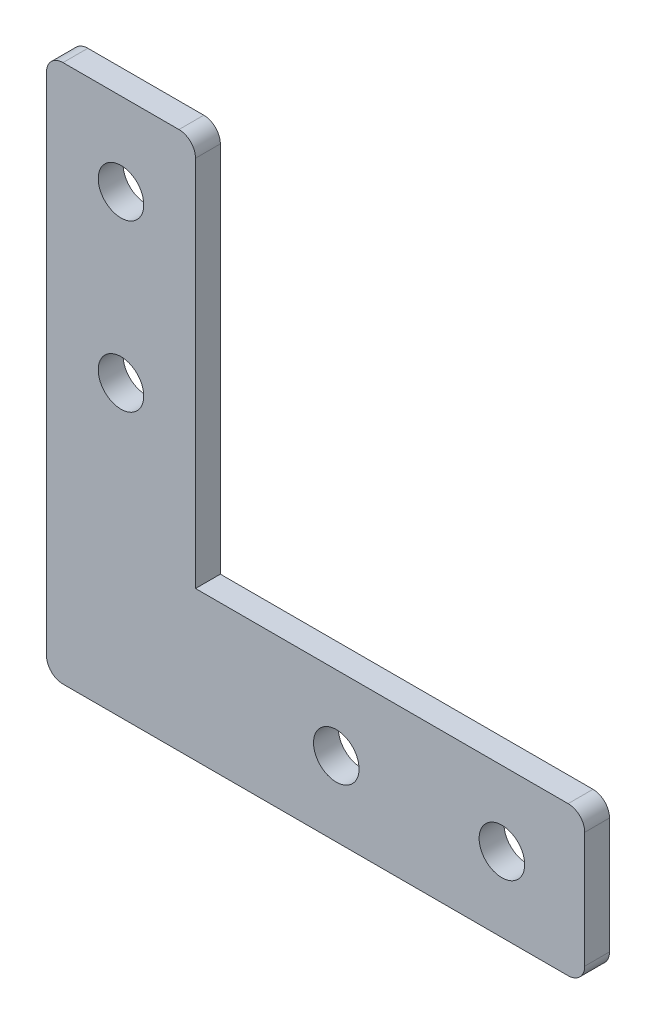
ISO-10303-21;
HEADER;
FILE_DESCRIPTION(('STEP AP214'),'2;1');
FILE_NAME('part.step','',(''),(''),'','','');
FILE_SCHEMA(('AUTOMOTIVE_DESIGN { 1 0 10303 214 1 1 1 1 }'));
ENDSEC;
DATA;
#1=APPLICATION_CONTEXT('core data for automotive mechanical design processes');
#2=APPLICATION_PROTOCOL_DEFINITION('international standard','automotive_design',2000,#1);
#3=PRODUCT_CONTEXT('',#1,'mechanical');
#4=PRODUCT('Part','Part','',(#3));
#5=PRODUCT_RELATED_PRODUCT_CATEGORY('part','',(#4));
#6=PRODUCT_DEFINITION_FORMATION('','',#4);
#7=PRODUCT_DEFINITION_CONTEXT('part definition',#1,'design');
#8=PRODUCT_DEFINITION('design','',#6,#7);
#9=PRODUCT_DEFINITION_SHAPE('','',#8);
#10=(LENGTH_UNIT() NAMED_UNIT(*) SI_UNIT(.MILLI.,.METRE.));
#11=(NAMED_UNIT(*) PLANE_ANGLE_UNIT() SI_UNIT($,.RADIAN.));
#12=(NAMED_UNIT(*) SI_UNIT($,.STERADIAN.) SOLID_ANGLE_UNIT());
#13=UNCERTAINTY_MEASURE_WITH_UNIT(LENGTH_MEASURE(1.E-05),#10,'distance_accuracy_value','');
#14=(GEOMETRIC_REPRESENTATION_CONTEXT(3) GLOBAL_UNCERTAINTY_ASSIGNED_CONTEXT((#13)) GLOBAL_UNIT_ASSIGNED_CONTEXT((#10,
#11,#12)) REPRESENTATION_CONTEXT('',''));
#15=CARTESIAN_POINT('',(0.,0.,0.));
#16=DIRECTION('',(0.,0.,1.));
#17=DIRECTION('',(1.,0.,0.));
#18=AXIS2_PLACEMENT_3D('',#15,#16,#17);
#19=CARTESIAN_POINT('',(47.,0.,3.));
#20=DIRECTION('',(0.,-1.,0.));
#21=DIRECTION('',(0.,0.,-1.));
#22=AXIS2_PLACEMENT_3D('',#19,#20,#21);
#23=PLANE('',#22);
#24=DIRECTION('',(-1.,0.,0.));
#25=VECTOR('',#24,1.);
#26=CARTESIAN_POINT('',(47.,0.,3.));
#27=LINE('',#26,#25);
#28=CARTESIAN_POINT('',(45.,0.,3.));
#29=VERTEX_POINT('',#28);
#30=CARTESIAN_POINT('',(0.,0.,3.));
#31=VERTEX_POINT('',#30);
#32=EDGE_CURVE('E116',#29,#31,#27,.T.);
#33=ORIENTED_EDGE('',*,*,#32,.F.);
#34=DIRECTION('',(0.,0.,-1.));
#35=VECTOR('',#34,1.);
#36=CARTESIAN_POINT('',(45.,0.,3.));
#37=LINE('',#36,#35);
#38=CARTESIAN_POINT('',(45.,0.,0.));
#39=VERTEX_POINT('',#38);
#40=EDGE_CURVE('E141',#29,#39,#37,.T.);
#41=ORIENTED_EDGE('',*,*,#40,.T.);
#42=DIRECTION('',(-1.,0.,0.));
#43=VECTOR('',#42,1.);
#44=CARTESIAN_POINT('',(47.,0.,0.));
#45=LINE('',#44,#43);
#46=CARTESIAN_POINT('',(0.,0.,0.));
#47=VERTEX_POINT('',#46);
#48=EDGE_CURVE('E139',#39,#47,#45,.T.);
#49=ORIENTED_EDGE('',*,*,#48,.T.);
#50=DIRECTION('',(0.,0.,-1.));
#51=VECTOR('',#50,1.);
#52=CARTESIAN_POINT('',(0.,0.,3.));
#53=LINE('',#52,#51);
#54=EDGE_CURVE('E134',#31,#47,#53,.T.);
#55=ORIENTED_EDGE('',*,*,#54,.F.);
#56=EDGE_LOOP('',(#33,#41,#49,#55));
#57=FACE_BOUND('',#56,.T.);
#58=ADVANCED_FACE('F33',(#57),#23,.F.);
#59=CARTESIAN_POINT('',(0.,0.,3.));
#60=DIRECTION('',(-1.,0.,0.));
#61=DIRECTION('',(0.,-1.,0.));
#62=AXIS2_PLACEMENT_3D('',#59,#60,#61);
#63=PLANE('',#62);
#64=DIRECTION('',(0.,1.,0.));
#65=VECTOR('',#64,1.);
#66=CARTESIAN_POINT('',(0.,0.,0.));
#67=LINE('',#66,#65);
#68=CARTESIAN_POINT('',(0.,45.,0.));
#69=VERTEX_POINT('',#68);
#70=EDGE_CURVE('E211',#47,#69,#67,.T.);
#71=ORIENTED_EDGE('',*,*,#70,.T.);
#72=DIRECTION('',(0.,0.,-1.));
#73=VECTOR('',#72,1.);
#74=CARTESIAN_POINT('',(0.,45.,3.));
#75=LINE('',#74,#73);
#76=CARTESIAN_POINT('',(0.,45.,3.));
#77=VERTEX_POINT('',#76);
#78=EDGE_CURVE('E11',#69,#77,#75,.F.);
#79=ORIENTED_EDGE('',*,*,#78,.T.);
#80=DIRECTION('',(0.,1.,0.));
#81=VECTOR('',#80,1.);
#82=CARTESIAN_POINT('',(0.,0.,3.));
#83=LINE('',#82,#81);
#84=EDGE_CURVE('E120',#31,#77,#83,.T.);
#85=ORIENTED_EDGE('',*,*,#84,.F.);
#86=ORIENTED_EDGE('',*,*,#54,.T.);
#87=EDGE_LOOP('',(#71,#79,#85,#86));
#88=FACE_BOUND('',#87,.T.);
#89=ADVANCED_FACE('F133',(#88),#63,.F.);
#90=CARTESIAN_POINT('',(0.,47.,3.));
#91=DIRECTION('',(0.,-1.,0.));
#92=DIRECTION('',(0.,0.,-1.));
#93=AXIS2_PLACEMENT_3D('',#90,#91,#92);
#94=PLANE('',#93);
#95=DIRECTION('',(-1.,0.,0.));
#96=VECTOR('',#95,1.);
#97=CARTESIAN_POINT('',(0.,47.,0.));
#98=LINE('',#97,#96);
#99=CARTESIAN_POINT('',(-2.,47.,0.));
#100=VERTEX_POINT('',#99);
#101=CARTESIAN_POINT('',(-16.,47.,0.));
#102=VERTEX_POINT('',#101);
#103=EDGE_CURVE('E192',#100,#102,#98,.T.);
#104=ORIENTED_EDGE('',*,*,#103,.T.);
#105=DIRECTION('',(0.,0.,-1.));
#106=VECTOR('',#105,1.);
#107=CARTESIAN_POINT('',(-16.,47.,3.));
#108=LINE('',#107,#106);
#109=CARTESIAN_POINT('',(-16.,47.,3.));
#110=VERTEX_POINT('',#109);
#111=EDGE_CURVE('E41',#102,#110,#108,.F.);
#112=ORIENTED_EDGE('',*,*,#111,.T.);
#113=DIRECTION('',(-1.,0.,0.));
#114=VECTOR('',#113,1.);
#115=CARTESIAN_POINT('',(0.,47.,3.));
#116=LINE('',#115,#114);
#117=CARTESIAN_POINT('',(-2.,47.,3.));
#118=VERTEX_POINT('',#117);
#119=EDGE_CURVE('E136',#118,#110,#116,.T.);
#120=ORIENTED_EDGE('',*,*,#119,.F.);
#121=DIRECTION('',(0.,0.,-1.));
#122=VECTOR('',#121,1.);
#123=CARTESIAN_POINT('',(-2.,47.,3.));
#124=LINE('',#123,#122);
#125=EDGE_CURVE('E182',#118,#100,#124,.T.);
#126=ORIENTED_EDGE('',*,*,#125,.T.);
#127=EDGE_LOOP('',(#104,#112,#120,#126));
#128=FACE_BOUND('',#127,.T.);
#129=ADVANCED_FACE('F189',(#128),#94,.F.);
#130=CARTESIAN_POINT('',(-18.,47.,3.));
#131=DIRECTION('',(1.,0.,0.));
#132=DIRECTION('',(0.,1.,0.));
#133=AXIS2_PLACEMENT_3D('',#130,#131,#132);
#134=PLANE('',#133);
#135=DIRECTION('',(0.,-1.,0.));
#136=VECTOR('',#135,1.);
#137=CARTESIAN_POINT('',(-18.,47.,0.));
#138=LINE('',#137,#136);
#139=CARTESIAN_POINT('',(-18.,45.,0.));
#140=VERTEX_POINT('',#139);
#141=CARTESIAN_POINT('',(-18.,-16.,0.));
#142=VERTEX_POINT('',#141);
#143=EDGE_CURVE('E204',#140,#142,#138,.T.);
#144=ORIENTED_EDGE('',*,*,#143,.T.);
#145=DIRECTION('',(0.,0.,-1.));
#146=VECTOR('',#145,1.);
#147=CARTESIAN_POINT('',(-18.,-16.,3.));
#148=LINE('',#147,#146);
#149=CARTESIAN_POINT('',(-18.,-16.,3.));
#150=VERTEX_POINT('',#149);
#151=EDGE_CURVE('E180',#142,#150,#148,.F.);
#152=ORIENTED_EDGE('',*,*,#151,.T.);
#153=DIRECTION('',(0.,-1.,0.));
#154=VECTOR('',#153,1.);
#155=CARTESIAN_POINT('',(-18.,47.,3.));
#156=LINE('',#155,#154);
#157=CARTESIAN_POINT('',(-18.,45.,3.));
#158=VERTEX_POINT('',#157);
#159=EDGE_CURVE('E196',#158,#150,#156,.T.);
#160=ORIENTED_EDGE('',*,*,#159,.F.);
#161=DIRECTION('',(0.,0.,-1.));
#162=VECTOR('',#161,1.);
#163=CARTESIAN_POINT('',(-18.,45.,3.));
#164=LINE('',#163,#162);
#165=EDGE_CURVE('E177',#158,#140,#164,.T.);
#166=ORIENTED_EDGE('',*,*,#165,.T.);
#167=EDGE_LOOP('',(#144,#152,#160,#166));
#168=FACE_BOUND('',#167,.T.);
#169=ADVANCED_FACE('F203',(#168),#134,.F.);
#170=CARTESIAN_POINT('',(-18.,-18.,3.));
#171=DIRECTION('',(0.,1.,0.));
#172=DIRECTION('',(0.,0.,1.));
#173=AXIS2_PLACEMENT_3D('',#170,#171,#172);
#174=PLANE('',#173);
#175=DIRECTION('',(1.,0.,0.));
#176=VECTOR('',#175,1.);
#177=CARTESIAN_POINT('',(-18.,-18.,0.));
#178=LINE('',#177,#176);
#179=CARTESIAN_POINT('',(-16.,-18.,0.));
#180=VERTEX_POINT('',#179);
#181=CARTESIAN_POINT('',(45.,-18.,0.));
#182=VERTEX_POINT('',#181);
#183=EDGE_CURVE('E209',#180,#182,#178,.T.);
#184=ORIENTED_EDGE('',*,*,#183,.T.);
#185=DIRECTION('',(0.,0.,-1.));
#186=VECTOR('',#185,1.);
#187=CARTESIAN_POINT('',(45.,-18.,3.));
#188=LINE('',#187,#186);
#189=CARTESIAN_POINT('',(45.,-18.,3.));
#190=VERTEX_POINT('',#189);
#191=EDGE_CURVE('E48',#182,#190,#188,.F.);
#192=ORIENTED_EDGE('',*,*,#191,.T.);
#193=DIRECTION('',(1.,0.,0.));
#194=VECTOR('',#193,1.);
#195=CARTESIAN_POINT('',(-18.,-18.,3.));
#196=LINE('',#195,#194);
#197=CARTESIAN_POINT('',(-16.,-18.,3.));
#198=VERTEX_POINT('',#197);
#199=EDGE_CURVE('E146',#198,#190,#196,.T.);
#200=ORIENTED_EDGE('',*,*,#199,.F.);
#201=DIRECTION('',(0.,0.,-1.));
#202=VECTOR('',#201,1.);
#203=CARTESIAN_POINT('',(-16.,-18.,3.));
#204=LINE('',#203,#202);
#205=EDGE_CURVE('E173',#198,#180,#204,.T.);
#206=ORIENTED_EDGE('',*,*,#205,.T.);
#207=EDGE_LOOP('',(#184,#192,#200,#206));
#208=FACE_BOUND('',#207,.T.);
#209=ADVANCED_FACE('F303',(#208),#174,.F.);
#210=CARTESIAN_POINT('',(47.,-18.,3.));
#211=DIRECTION('',(-1.,0.,0.));
#212=DIRECTION('',(0.,-1.,0.));
#213=AXIS2_PLACEMENT_3D('',#210,#211,#212);
#214=PLANE('',#213);
#215=DIRECTION('',(0.,1.,0.));
#216=VECTOR('',#215,1.);
#217=CARTESIAN_POINT('',(47.,-18.,0.));
#218=LINE('',#217,#216);
#219=CARTESIAN_POINT('',(47.,-16.,0.));
#220=VERTEX_POINT('',#219);
#221=CARTESIAN_POINT('',(47.,-2.,0.));
#222=VERTEX_POINT('',#221);
#223=EDGE_CURVE('E128',#220,#222,#218,.T.);
#224=ORIENTED_EDGE('',*,*,#223,.T.);
#225=DIRECTION('',(0.,0.,-1.));
#226=VECTOR('',#225,1.);
#227=CARTESIAN_POINT('',(47.,-2.,3.));
#228=LINE('',#227,#226);
#229=CARTESIAN_POINT('',(47.,-2.,3.));
#230=VERTEX_POINT('',#229);
#231=EDGE_CURVE('E163',#222,#230,#228,.F.);
#232=ORIENTED_EDGE('',*,*,#231,.T.);
#233=DIRECTION('',(0.,1.,0.));
#234=VECTOR('',#233,1.);
#235=CARTESIAN_POINT('',(47.,-18.,3.));
#236=LINE('',#235,#234);
#237=CARTESIAN_POINT('',(47.,-16.,3.));
#238=VERTEX_POINT('',#237);
#239=EDGE_CURVE('E142',#238,#230,#236,.T.);
#240=ORIENTED_EDGE('',*,*,#239,.F.);
#241=DIRECTION('',(0.,0.,-1.));
#242=VECTOR('',#241,1.);
#243=CARTESIAN_POINT('',(47.,-16.,3.));
#244=LINE('',#243,#242);
#245=EDGE_CURVE('E160',#238,#220,#244,.T.);
#246=ORIENTED_EDGE('',*,*,#245,.T.);
#247=EDGE_LOOP('',(#224,#232,#240,#246));
#248=FACE_BOUND('',#247,.T.);
#249=ADVANCED_FACE('F247',(#248),#214,.F.);
#250=CARTESIAN_POINT('',(0.,0.,3.));
#251=DIRECTION('',(0.,0.,-1.));
#252=DIRECTION('',(-1.,0.,0.));
#253=AXIS2_PLACEMENT_3D('',#250,#251,#252);
#254=PLANE('',#253);
#255=CARTESIAN_POINT('',(-9.,37.,3.));
#256=DIRECTION('',(0.,0.,1.));
#257=DIRECTION('',(1.,0.,0.));
#258=AXIS2_PLACEMENT_3D('',#255,#256,#257);
#259=CIRCLE('',#258,2.75);
#260=CARTESIAN_POINT('',(-6.25,37.,3.));
#261=VERTEX_POINT('',#260);
#262=EDGE_CURVE('E239',#261,#261,#259,.T.);
#263=ORIENTED_EDGE('',*,*,#262,.F.);
#264=EDGE_LOOP('',(#263));
#265=FACE_BOUND('',#264,.T.);
#266=CARTESIAN_POINT('',(-9.,17.,3.));
#267=DIRECTION('',(0.,0.,1.));
#268=DIRECTION('',(1.,0.,0.));
#269=AXIS2_PLACEMENT_3D('',#266,#267,#268);
#270=CIRCLE('',#269,2.75);
#271=CARTESIAN_POINT('',(-6.25,17.,3.));
#272=VERTEX_POINT('',#271);
#273=EDGE_CURVE('E233',#272,#272,#270,.T.);
#274=ORIENTED_EDGE('',*,*,#273,.F.);
#275=EDGE_LOOP('',(#274));
#276=FACE_BOUND('',#275,.T.);
#277=CARTESIAN_POINT('',(37.,-9.,3.));
#278=DIRECTION('',(0.,0.,1.));
#279=DIRECTION('',(1.,0.,0.));
#280=AXIS2_PLACEMENT_3D('',#277,#278,#279);
#281=CIRCLE('',#280,2.75);
#282=CARTESIAN_POINT('',(39.75,-9.,3.));
#283=VERTEX_POINT('',#282);
#284=EDGE_CURVE('E227',#283,#283,#281,.T.);
#285=ORIENTED_EDGE('',*,*,#284,.F.);
#286=EDGE_LOOP('',(#285));
#287=FACE_BOUND('',#286,.T.);
#288=CARTESIAN_POINT('',(17.,-9.,3.));
#289=DIRECTION('',(0.,0.,1.));
#290=DIRECTION('',(1.,0.,0.));
#291=AXIS2_PLACEMENT_3D('',#288,#289,#290);
#292=CIRCLE('',#291,2.75);
#293=CARTESIAN_POINT('',(19.75,-9.,3.));
#294=VERTEX_POINT('',#293);
#295=EDGE_CURVE('E221',#294,#294,#292,.T.);
#296=ORIENTED_EDGE('',*,*,#295,.F.);
#297=EDGE_LOOP('',(#296));
#298=FACE_BOUND('',#297,.T.);
#299=ORIENTED_EDGE('',*,*,#239,.T.);
#300=CARTESIAN_POINT('',(45.,-2.,3.));
#301=DIRECTION('',(0.,0.,-1.));
#302=DIRECTION('',(-1.,0.,0.));
#303=AXIS2_PLACEMENT_3D('',#300,#301,#302);
#304=CIRCLE('',#303,2.);
#305=EDGE_CURVE('E123',#230,#29,#304,.F.);
#306=ORIENTED_EDGE('',*,*,#305,.T.);
#307=ORIENTED_EDGE('',*,*,#32,.T.);
#308=ORIENTED_EDGE('',*,*,#84,.T.);
#309=CARTESIAN_POINT('',(-2.,45.,3.));
#310=DIRECTION('',(0.,0.,-1.));
#311=DIRECTION('',(-1.,0.,0.));
#312=AXIS2_PLACEMENT_3D('',#309,#310,#311);
#313=CIRCLE('',#312,2.);
#314=EDGE_CURVE('E165',#77,#118,#313,.F.);
#315=ORIENTED_EDGE('',*,*,#314,.T.);
#316=ORIENTED_EDGE('',*,*,#119,.T.);
#317=CARTESIAN_POINT('',(-16.,45.,3.));
#318=DIRECTION('',(0.,0.,-1.));
#319=DIRECTION('',(-1.,0.,0.));
#320=AXIS2_PLACEMENT_3D('',#317,#318,#319);
#321=CIRCLE('',#320,2.);
#322=EDGE_CURVE('E167',#110,#158,#321,.F.);
#323=ORIENTED_EDGE('',*,*,#322,.T.);
#324=ORIENTED_EDGE('',*,*,#159,.T.);
#325=CARTESIAN_POINT('',(-16.,-16.,3.));
#326=DIRECTION('',(0.,0.,-1.));
#327=DIRECTION('',(-1.,0.,0.));
#328=AXIS2_PLACEMENT_3D('',#325,#326,#327);
#329=CIRCLE('',#328,2.);
#330=EDGE_CURVE('E55',#150,#198,#329,.F.);
#331=ORIENTED_EDGE('',*,*,#330,.T.);
#332=ORIENTED_EDGE('',*,*,#199,.T.);
#333=CARTESIAN_POINT('',(45.,-16.,3.));
#334=DIRECTION('',(0.,0.,-1.));
#335=DIRECTION('',(-1.,0.,0.));
#336=AXIS2_PLACEMENT_3D('',#333,#334,#335);
#337=CIRCLE('',#336,2.);
#338=EDGE_CURVE('E170',#190,#238,#337,.F.);
#339=ORIENTED_EDGE('',*,*,#338,.T.);
#340=EDGE_LOOP('',(#299,#306,#307,#308,#315,#316,#323,#324,#331,#332,#339));
#341=FACE_BOUND('',#340,.T.);
#342=ADVANCED_FACE('F119',(#265,#276,#287,#298,#341),#254,.F.);
#343=CARTESIAN_POINT('',(0.,0.,0.));
#344=DIRECTION('',(0.,0.,-1.));
#345=DIRECTION('',(-1.,0.,0.));
#346=AXIS2_PLACEMENT_3D('',#343,#344,#345);
#347=PLANE('',#346);
#348=CARTESIAN_POINT('',(-9.,37.,0.));
#349=DIRECTION('',(0.,0.,1.));
#350=DIRECTION('',(1.,0.,0.));
#351=AXIS2_PLACEMENT_3D('',#348,#349,#350);
#352=CIRCLE('',#351,2.75);
#353=CARTESIAN_POINT('',(-6.25,37.,0.));
#354=VERTEX_POINT('',#353);
#355=EDGE_CURVE('E236',#354,#354,#352,.T.);
#356=ORIENTED_EDGE('',*,*,#355,.T.);
#357=EDGE_LOOP('',(#356));
#358=FACE_BOUND('',#357,.T.);
#359=CARTESIAN_POINT('',(-9.,17.,0.));
#360=DIRECTION('',(0.,0.,1.));
#361=DIRECTION('',(1.,0.,0.));
#362=AXIS2_PLACEMENT_3D('',#359,#360,#361);
#363=CIRCLE('',#362,2.75);
#364=CARTESIAN_POINT('',(-6.25,17.,0.));
#365=VERTEX_POINT('',#364);
#366=EDGE_CURVE('E230',#365,#365,#363,.T.);
#367=ORIENTED_EDGE('',*,*,#366,.T.);
#368=EDGE_LOOP('',(#367));
#369=FACE_BOUND('',#368,.T.);
#370=CARTESIAN_POINT('',(37.,-9.,0.));
#371=DIRECTION('',(0.,0.,1.));
#372=DIRECTION('',(1.,0.,0.));
#373=AXIS2_PLACEMENT_3D('',#370,#371,#372);
#374=CIRCLE('',#373,2.75);
#375=CARTESIAN_POINT('',(39.75,-9.,0.));
#376=VERTEX_POINT('',#375);
#377=EDGE_CURVE('E224',#376,#376,#374,.T.);
#378=ORIENTED_EDGE('',*,*,#377,.T.);
#379=EDGE_LOOP('',(#378));
#380=FACE_BOUND('',#379,.T.);
#381=CARTESIAN_POINT('',(17.,-9.,0.));
#382=DIRECTION('',(0.,0.,1.));
#383=DIRECTION('',(1.,0.,0.));
#384=AXIS2_PLACEMENT_3D('',#381,#382,#383);
#385=CIRCLE('',#384,2.75);
#386=CARTESIAN_POINT('',(19.75,-9.,0.));
#387=VERTEX_POINT('',#386);
#388=EDGE_CURVE('E215',#387,#387,#385,.T.);
#389=ORIENTED_EDGE('',*,*,#388,.T.);
#390=EDGE_LOOP('',(#389));
#391=FACE_BOUND('',#390,.T.);
#392=ORIENTED_EDGE('',*,*,#48,.F.);
#393=CARTESIAN_POINT('',(45.,-2.,0.));
#394=DIRECTION('',(0.,0.,-1.));
#395=DIRECTION('',(-1.,0.,0.));
#396=AXIS2_PLACEMENT_3D('',#393,#394,#395);
#397=CIRCLE('',#396,2.);
#398=EDGE_CURVE('E158',#39,#222,#397,.T.);
#399=ORIENTED_EDGE('',*,*,#398,.T.);
#400=ORIENTED_EDGE('',*,*,#223,.F.);
#401=CARTESIAN_POINT('',(45.,-16.,0.));
#402=DIRECTION('',(0.,0.,-1.));
#403=DIRECTION('',(-1.,0.,0.));
#404=AXIS2_PLACEMENT_3D('',#401,#402,#403);
#405=CIRCLE('',#404,2.);
#406=EDGE_CURVE('E156',#220,#182,#405,.T.);
#407=ORIENTED_EDGE('',*,*,#406,.T.);
#408=ORIENTED_EDGE('',*,*,#183,.F.);
#409=CARTESIAN_POINT('',(-16.,-16.,0.));
#410=DIRECTION('',(0.,0.,-1.));
#411=DIRECTION('',(-1.,0.,0.));
#412=AXIS2_PLACEMENT_3D('',#409,#410,#411);
#413=CIRCLE('',#412,2.);
#414=EDGE_CURVE('E154',#180,#142,#413,.T.);
#415=ORIENTED_EDGE('',*,*,#414,.T.);
#416=ORIENTED_EDGE('',*,*,#143,.F.);
#417=CARTESIAN_POINT('',(-16.,45.,0.));
#418=DIRECTION('',(0.,0.,-1.));
#419=DIRECTION('',(-1.,0.,0.));
#420=AXIS2_PLACEMENT_3D('',#417,#418,#419);
#421=CIRCLE('',#420,2.);
#422=EDGE_CURVE('E152',#140,#102,#421,.T.);
#423=ORIENTED_EDGE('',*,*,#422,.T.);
#424=ORIENTED_EDGE('',*,*,#103,.F.);
#425=CARTESIAN_POINT('',(-2.,45.,0.));
#426=DIRECTION('',(0.,0.,-1.));
#427=DIRECTION('',(-1.,0.,0.));
#428=AXIS2_PLACEMENT_3D('',#425,#426,#427);
#429=CIRCLE('',#428,2.);
#430=EDGE_CURVE('E144',#100,#69,#429,.T.);
#431=ORIENTED_EDGE('',*,*,#430,.T.);
#432=ORIENTED_EDGE('',*,*,#70,.F.);
#433=EDGE_LOOP('',(#392,#399,#400,#407,#408,#415,#416,#423,#424,#431,#432));
#434=FACE_BOUND('',#433,.T.);
#435=ADVANCED_FACE('F207',(#358,#369,#380,#391,#434),#347,.T.);
#436=CARTESIAN_POINT('',(17.,-9.,3.));
#437=DIRECTION('',(0.,0.,1.));
#438=DIRECTION('',(1.,0.,0.));
#439=AXIS2_PLACEMENT_3D('',#436,#437,#438);
#440=CYLINDRICAL_SURFACE('',#439,2.75);
#441=ORIENTED_EDGE('',*,*,#388,.F.);
#442=EDGE_LOOP('',(#441));
#443=FACE_BOUND('',#442,.T.);
#444=ORIENTED_EDGE('',*,*,#295,.T.);
#445=EDGE_LOOP('',(#444));
#446=FACE_BOUND('',#445,.T.);
#447=ADVANCED_FACE('F255',(#443,#446),#440,.F.);
#448=CARTESIAN_POINT('',(37.,-9.,3.));
#449=DIRECTION('',(0.,0.,1.));
#450=DIRECTION('',(1.,0.,0.));
#451=AXIS2_PLACEMENT_3D('',#448,#449,#450);
#452=CYLINDRICAL_SURFACE('',#451,2.75);
#453=ORIENTED_EDGE('',*,*,#377,.F.);
#454=EDGE_LOOP('',(#453));
#455=FACE_BOUND('',#454,.T.);
#456=ORIENTED_EDGE('',*,*,#284,.T.);
#457=EDGE_LOOP('',(#456));
#458=FACE_BOUND('',#457,.T.);
#459=ADVANCED_FACE('F257',(#455,#458),#452,.F.);
#460=CARTESIAN_POINT('',(-9.,17.,3.));
#461=DIRECTION('',(0.,0.,1.));
#462=DIRECTION('',(1.,0.,0.));
#463=AXIS2_PLACEMENT_3D('',#460,#461,#462);
#464=CYLINDRICAL_SURFACE('',#463,2.75);
#465=ORIENTED_EDGE('',*,*,#366,.F.);
#466=EDGE_LOOP('',(#465));
#467=FACE_BOUND('',#466,.T.);
#468=ORIENTED_EDGE('',*,*,#273,.T.);
#469=EDGE_LOOP('',(#468));
#470=FACE_BOUND('',#469,.T.);
#471=ADVANCED_FACE('F264',(#467,#470),#464,.F.);
#472=CARTESIAN_POINT('',(-9.,37.,3.));
#473=DIRECTION('',(0.,0.,1.));
#474=DIRECTION('',(1.,0.,0.));
#475=AXIS2_PLACEMENT_3D('',#472,#473,#474);
#476=CYLINDRICAL_SURFACE('',#475,2.75);
#477=ORIENTED_EDGE('',*,*,#355,.F.);
#478=EDGE_LOOP('',(#477));
#479=FACE_BOUND('',#478,.T.);
#480=ORIENTED_EDGE('',*,*,#262,.T.);
#481=EDGE_LOOP('',(#480));
#482=FACE_BOUND('',#481,.T.);
#483=ADVANCED_FACE('F243',(#479,#482),#476,.F.);
#484=CARTESIAN_POINT('',(45.,-2.,3.));
#485=DIRECTION('',(0.,0.,-1.));
#486=DIRECTION('',(-1.,0.,0.));
#487=AXIS2_PLACEMENT_3D('',#484,#485,#486);
#488=CYLINDRICAL_SURFACE('',#487,2.);
#489=ORIENTED_EDGE('',*,*,#305,.F.);
#490=ORIENTED_EDGE('',*,*,#231,.F.);
#491=ORIENTED_EDGE('',*,*,#398,.F.);
#492=ORIENTED_EDGE('',*,*,#40,.F.);
#493=EDGE_LOOP('',(#489,#490,#491,#492));
#494=FACE_BOUND('',#493,.T.);
#495=ADVANCED_FACE('F278',(#494),#488,.T.);
#496=CARTESIAN_POINT('',(45.,-16.,3.));
#497=DIRECTION('',(0.,0.,-1.));
#498=DIRECTION('',(-1.,0.,0.));
#499=AXIS2_PLACEMENT_3D('',#496,#497,#498);
#500=CYLINDRICAL_SURFACE('',#499,2.);
#501=ORIENTED_EDGE('',*,*,#338,.F.);
#502=ORIENTED_EDGE('',*,*,#191,.F.);
#503=ORIENTED_EDGE('',*,*,#406,.F.);
#504=ORIENTED_EDGE('',*,*,#245,.F.);
#505=EDGE_LOOP('',(#501,#502,#503,#504));
#506=FACE_BOUND('',#505,.T.);
#507=ADVANCED_FACE('F281',(#506),#500,.T.);
#508=CARTESIAN_POINT('',(-16.,-16.,3.));
#509=DIRECTION('',(0.,0.,-1.));
#510=DIRECTION('',(-1.,0.,0.));
#511=AXIS2_PLACEMENT_3D('',#508,#509,#510);
#512=CYLINDRICAL_SURFACE('',#511,2.);
#513=ORIENTED_EDGE('',*,*,#330,.F.);
#514=ORIENTED_EDGE('',*,*,#151,.F.);
#515=ORIENTED_EDGE('',*,*,#414,.F.);
#516=ORIENTED_EDGE('',*,*,#205,.F.);
#517=EDGE_LOOP('',(#513,#514,#515,#516));
#518=FACE_BOUND('',#517,.T.);
#519=ADVANCED_FACE('F285',(#518),#512,.T.);
#520=CARTESIAN_POINT('',(-16.,45.,3.));
#521=DIRECTION('',(0.,0.,-1.));
#522=DIRECTION('',(-1.,0.,0.));
#523=AXIS2_PLACEMENT_3D('',#520,#521,#522);
#524=CYLINDRICAL_SURFACE('',#523,2.);
#525=ORIENTED_EDGE('',*,*,#322,.F.);
#526=ORIENTED_EDGE('',*,*,#111,.F.);
#527=ORIENTED_EDGE('',*,*,#422,.F.);
#528=ORIENTED_EDGE('',*,*,#165,.F.);
#529=EDGE_LOOP('',(#525,#526,#527,#528));
#530=FACE_BOUND('',#529,.T.);
#531=ADVANCED_FACE('F199',(#530),#524,.T.);
#532=CARTESIAN_POINT('',(-2.,45.,3.));
#533=DIRECTION('',(0.,0.,-1.));
#534=DIRECTION('',(-1.,0.,0.));
#535=AXIS2_PLACEMENT_3D('',#532,#533,#534);
#536=CYLINDRICAL_SURFACE('',#535,2.);
#537=ORIENTED_EDGE('',*,*,#314,.F.);
#538=ORIENTED_EDGE('',*,*,#78,.F.);
#539=ORIENTED_EDGE('',*,*,#430,.F.);
#540=ORIENTED_EDGE('',*,*,#125,.F.);
#541=EDGE_LOOP('',(#537,#538,#539,#540));
#542=FACE_BOUND('',#541,.T.);
#543=ADVANCED_FACE('F35',(#542),#536,.T.);
#544=CLOSED_SHELL('',(#58,#89,#129,#169,#209,#249,#342,#435,#447,#459,#471,#483,#495,#507,#519,
#531,#543));
#545=MANIFOLD_SOLID_BREP('B2',#544);
#546=ADVANCED_BREP_SHAPE_REPRESENTATION('',(#18,#545),#14);
#547=SHAPE_DEFINITION_REPRESENTATION(#9,#546);
ENDSEC;
END-ISO-10303-21;
